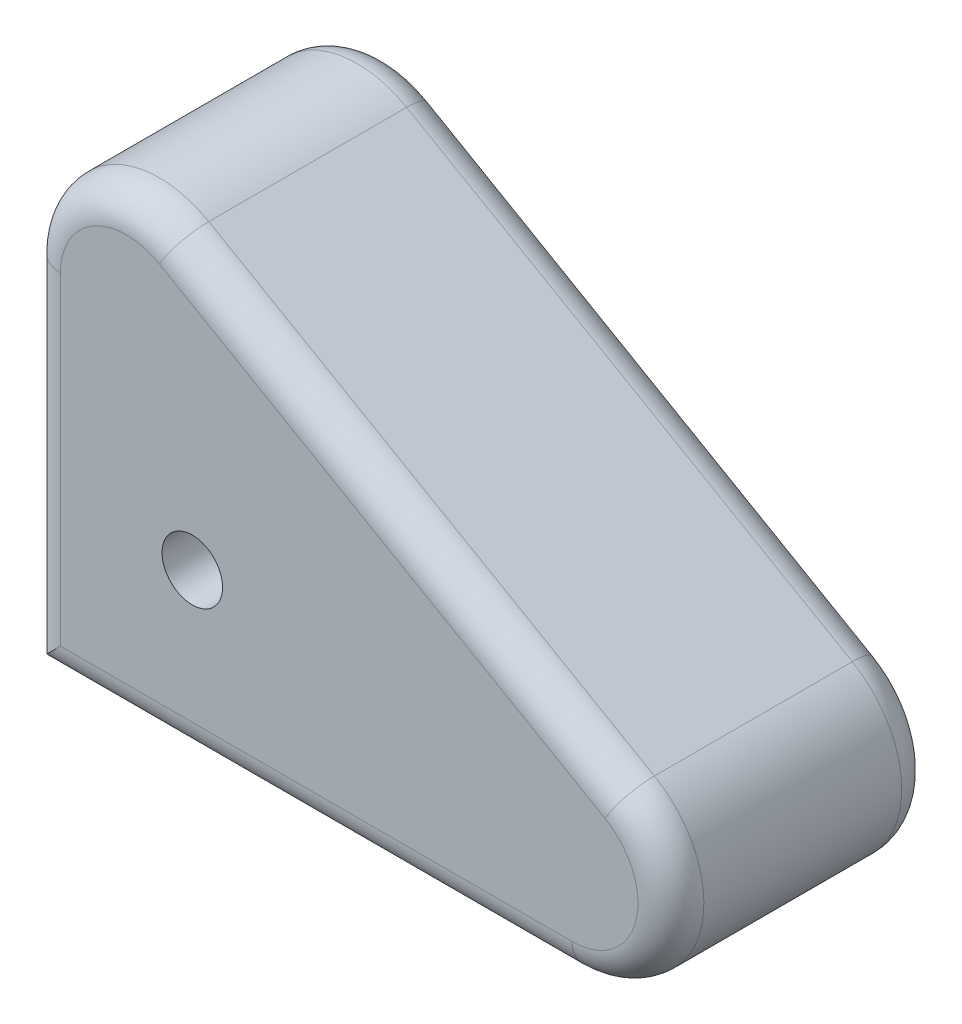
ISO-10303-21;
HEADER;
FILE_DESCRIPTION(('STEP AP214'),'2;1');
FILE_NAME('part.step','',(''),(''),'','','');
FILE_SCHEMA(('AUTOMOTIVE_DESIGN { 1 0 10303 214 1 1 1 1 }'));
ENDSEC;
DATA;
#1=APPLICATION_CONTEXT('core data for automotive mechanical design processes');
#2=APPLICATION_PROTOCOL_DEFINITION('international standard','automotive_design',2000,#1);
#3=PRODUCT_CONTEXT('',#1,'mechanical');
#4=PRODUCT('Part','Part','',(#3));
#5=PRODUCT_RELATED_PRODUCT_CATEGORY('part','',(#4));
#6=PRODUCT_DEFINITION_FORMATION('','',#4);
#7=PRODUCT_DEFINITION_CONTEXT('part definition',#1,'design');
#8=PRODUCT_DEFINITION('design','',#6,#7);
#9=PRODUCT_DEFINITION_SHAPE('','',#8);
#10=(LENGTH_UNIT() NAMED_UNIT(*) SI_UNIT(.MILLI.,.METRE.));
#11=(NAMED_UNIT(*) PLANE_ANGLE_UNIT() SI_UNIT($,.RADIAN.));
#12=(NAMED_UNIT(*) SI_UNIT($,.STERADIAN.) SOLID_ANGLE_UNIT());
#13=UNCERTAINTY_MEASURE_WITH_UNIT(LENGTH_MEASURE(1.E-05),#10,'distance_accuracy_value','');
#14=(GEOMETRIC_REPRESENTATION_CONTEXT(3) GLOBAL_UNCERTAINTY_ASSIGNED_CONTEXT((#13)) GLOBAL_UNIT_ASSIGNED_CONTEXT((#10,
#11,#12)) REPRESENTATION_CONTEXT('',''));
#15=CARTESIAN_POINT('',(0.,0.,0.));
#16=DIRECTION('',(0.,0.,1.));
#17=DIRECTION('',(1.,0.,0.));
#18=AXIS2_PLACEMENT_3D('',#15,#16,#17);
#19=CARTESIAN_POINT('',(73.1307941648125,-12.7,50.8000000000001));
#20=DIRECTION('',(0.,0.,-1.));
#21=DIRECTION('',(-1.,0.,0.));
#22=AXIS2_PLACEMENT_3D('',#19,#20,#21);
#23=PLANE('',#22);
#24=DIRECTION('',(0.,-1.,0.));
#25=VECTOR('',#24,1.);
#26=CARTESIAN_POINT('',(-25.4,-12.7,50.8000000000001));
#27=LINE('',#26,#25);
#28=CARTESIAN_POINT('',(-25.4,36.8544321158131,50.8000000000001));
#29=VERTEX_POINT('',#28);
#30=CARTESIAN_POINT('',(-25.4,-25.4,50.8000000000001));
#31=VERTEX_POINT('',#30);
#32=EDGE_CURVE('E65',#29,#31,#27,.T.);
#33=ORIENTED_EDGE('',*,*,#32,.T.);
#34=DIRECTION('',(1.,0.,0.));
#35=VECTOR('',#34,1.);
#36=CARTESIAN_POINT('',(73.1307941648125,-25.4,50.8000000000001));
#37=LINE('',#36,#35);
#38=CARTESIAN_POINT('',(73.1307941648124,-25.4,50.8000000000001));
#39=VERTEX_POINT('',#38);
#40=EDGE_CURVE('E233',#31,#39,#37,.T.);
#41=ORIENTED_EDGE('',*,*,#40,.T.);
#42=CARTESIAN_POINT('',(73.1307941648125,-12.7,50.8000000000001));
#43=DIRECTION('',(0.,0.,-1.));
#44=DIRECTION('',(-1.,0.,0.));
#45=AXIS2_PLACEMENT_3D('',#42,#43,#44);
#46=CIRCLE('',#45,12.7);
#47=CARTESIAN_POINT('',(79.4807941648123,-1.7014773719376,50.8000000000001));
#48=VERTEX_POINT('',#47);
#49=EDGE_CURVE('E150',#39,#48,#46,.F.);
#50=ORIENTED_EDGE('',*,*,#49,.T.);
#51=DIRECTION('',(-0.866025403784442,0.499999999999995,0.));
#52=VECTOR('',#51,1.);
#53=CARTESIAN_POINT('',(79.4807941648124,-1.70147737193762,50.8000000000001));
#54=LINE('',#53,#52);
#55=CARTESIAN_POINT('',(-6.35000000000008,47.8529547438755,50.8000000000001));
#56=VERTEX_POINT('',#55);
#57=EDGE_CURVE('E227',#48,#56,#54,.T.);
#58=ORIENTED_EDGE('',*,*,#57,.T.);
#59=CARTESIAN_POINT('',(-12.7,36.8544321158131,50.8000000000001));
#60=DIRECTION('',(0.,0.,-1.));
#61=DIRECTION('',(-1.,0.,0.));
#62=AXIS2_PLACEMENT_3D('',#59,#60,#61);
#63=CIRCLE('',#62,12.7);
#64=EDGE_CURVE('E229',#56,#29,#63,.F.);
#65=ORIENTED_EDGE('',*,*,#64,.T.);
#66=EDGE_LOOP('',(#33,#41,#50,#58,#65));
#67=FACE_BOUND('',#66,.T.);
#68=CARTESIAN_POINT('',(0.,0.,50.8000000000001));
#69=DIRECTION('',(0.,0.,1.));
#70=DIRECTION('',(1.,0.,0.));
#71=AXIS2_PLACEMENT_3D('',#68,#69,#70);
#72=CIRCLE('',#71,5.83012271365525);
#73=CARTESIAN_POINT('',(5.83012271365525,0.,50.8000000000001));
#74=VERTEX_POINT('',#73);
#75=EDGE_CURVE('E192',#74,#74,#72,.T.);
#76=ORIENTED_EDGE('',*,*,#75,.F.);
#77=EDGE_LOOP('',(#76));
#78=FACE_BOUND('',#77,.T.);
#79=ADVANCED_FACE('F40',(#67,#78),#23,.F.);
#80=CARTESIAN_POINT('',(73.1307941648125,-12.7,0.));
#81=DIRECTION('',(0.,0.,-1.));
#82=DIRECTION('',(-1.,0.,0.));
#83=AXIS2_PLACEMENT_3D('',#80,#81,#82);
#84=PLANE('',#83);
#85=CARTESIAN_POINT('',(73.1307941648125,-12.7,0.));
#86=DIRECTION('',(0.,0.,-1.));
#87=DIRECTION('',(-1.,0.,0.));
#88=AXIS2_PLACEMENT_3D('',#85,#86,#87);
#89=CIRCLE('',#88,12.7);
#90=CARTESIAN_POINT('',(79.4807941648123,-1.7014773719376,0.));
#91=VERTEX_POINT('',#90);
#92=CARTESIAN_POINT('',(73.1307941648124,-25.4,0.));
#93=VERTEX_POINT('',#92);
#94=EDGE_CURVE('E214',#91,#93,#89,.T.);
#95=ORIENTED_EDGE('',*,*,#94,.T.);
#96=DIRECTION('',(1.,0.,0.));
#97=VECTOR('',#96,1.);
#98=CARTESIAN_POINT('',(-31.75,-25.4,0.));
#99=LINE('',#98,#97);
#100=CARTESIAN_POINT('',(-25.4,-25.4,0.));
#101=VERTEX_POINT('',#100);
#102=EDGE_CURVE('E132',#93,#101,#99,.F.);
#103=ORIENTED_EDGE('',*,*,#102,.T.);
#104=DIRECTION('',(0.,-1.,0.));
#105=VECTOR('',#104,1.);
#106=CARTESIAN_POINT('',(-25.4,36.8544321158131,0.));
#107=LINE('',#106,#105);
#108=CARTESIAN_POINT('',(-25.4,36.8544321158131,0.));
#109=VERTEX_POINT('',#108);
#110=EDGE_CURVE('E212',#101,#109,#107,.F.);
#111=ORIENTED_EDGE('',*,*,#110,.T.);
#112=CARTESIAN_POINT('',(-12.7,36.8544321158131,0.));
#113=DIRECTION('',(0.,0.,-1.));
#114=DIRECTION('',(-1.,0.,0.));
#115=AXIS2_PLACEMENT_3D('',#112,#113,#114);
#116=CIRCLE('',#115,12.7);
#117=CARTESIAN_POINT('',(-6.35000000000008,47.8529547438755,0.));
#118=VERTEX_POINT('',#117);
#119=EDGE_CURVE('E210',#109,#118,#116,.T.);
#120=ORIENTED_EDGE('',*,*,#119,.T.);
#121=DIRECTION('',(-0.866025403784442,0.499999999999995,0.));
#122=VECTOR('',#121,1.);
#123=CARTESIAN_POINT('',(79.4807941648123,-1.70147737193759,0.));
#124=LINE('',#123,#122);
#125=EDGE_CURVE('E208',#118,#91,#124,.F.);
#126=ORIENTED_EDGE('',*,*,#125,.T.);
#127=EDGE_LOOP('',(#95,#103,#111,#120,#126));
#128=FACE_BOUND('',#127,.T.);
#129=CARTESIAN_POINT('',(0.,0.,0.));
#130=DIRECTION('',(0.,0.,1.));
#131=DIRECTION('',(1.,0.,0.));
#132=AXIS2_PLACEMENT_3D('',#129,#130,#131);
#133=CIRCLE('',#132,5.83012271365525);
#134=CARTESIAN_POINT('',(5.83012271365525,0.,0.));
#135=VERTEX_POINT('',#134);
#136=EDGE_CURVE('E186',#135,#135,#133,.T.);
#137=ORIENTED_EDGE('',*,*,#136,.T.);
#138=EDGE_LOOP('',(#137));
#139=FACE_BOUND('',#138,.T.);
#140=ADVANCED_FACE('F266',(#128,#139),#84,.T.);
#141=CARTESIAN_POINT('',(-31.75,36.8544321158131,50.8000000000001));
#142=DIRECTION('',(1.,0.,0.));
#143=DIRECTION('',(0.,1.,0.));
#144=AXIS2_PLACEMENT_3D('',#141,#142,#143);
#145=PLANE('',#144);
#146=DIRECTION('',(0.,0.,-1.));
#147=VECTOR('',#146,1.);
#148=CARTESIAN_POINT('',(-31.75,36.8544321158131,50.8000000000001));
#149=LINE('',#148,#147);
#150=CARTESIAN_POINT('',(-31.75,36.8544321158131,44.4500000000001));
#151=VERTEX_POINT('',#150);
#152=CARTESIAN_POINT('',(-31.75,36.8544321158131,6.35000000000001));
#153=VERTEX_POINT('',#152);
#154=EDGE_CURVE('E197',#151,#153,#149,.T.);
#155=ORIENTED_EDGE('',*,*,#154,.T.);
#156=DIRECTION('',(0.,-1.,0.));
#157=VECTOR('',#156,1.);
#158=CARTESIAN_POINT('',(-31.75,-31.75,6.35));
#159=LINE('',#158,#157);
#160=CARTESIAN_POINT('',(-31.75,-31.75,6.35000000000002));
#161=VERTEX_POINT('',#160);
#162=EDGE_CURVE('E221',#153,#161,#159,.T.);
#163=ORIENTED_EDGE('',*,*,#162,.T.);
#164=DIRECTION('',(0.,0.,-1.));
#165=VECTOR('',#164,1.);
#166=CARTESIAN_POINT('',(-31.75,-31.75,50.8000000000001));
#167=LINE('',#166,#165);
#168=CARTESIAN_POINT('',(-31.75,-31.75,44.4500000000001));
#169=VERTEX_POINT('',#168);
#170=EDGE_CURVE('E143',#169,#161,#167,.T.);
#171=ORIENTED_EDGE('',*,*,#170,.F.);
#172=DIRECTION('',(0.,-1.,0.));
#173=VECTOR('',#172,1.);
#174=CARTESIAN_POINT('',(-31.75,36.8544321158131,44.4500000000001));
#175=LINE('',#174,#173);
#176=EDGE_CURVE('E219',#169,#151,#175,.F.);
#177=ORIENTED_EDGE('',*,*,#176,.T.);
#178=EDGE_LOOP('',(#155,#163,#171,#177));
#179=FACE_BOUND('',#178,.T.);
#180=ADVANCED_FACE('F245',(#179),#145,.F.);
#181=CARTESIAN_POINT('',(-31.75,-31.75,50.8000000000001));
#182=DIRECTION('',(0.,1.,0.));
#183=DIRECTION('',(0.,0.,1.));
#184=AXIS2_PLACEMENT_3D('',#181,#182,#183);
#185=PLANE('',#184);
#186=ORIENTED_EDGE('',*,*,#170,.T.);
#187=DIRECTION('',(1.,0.,0.));
#188=VECTOR('',#187,1.);
#189=CARTESIAN_POINT('',(73.1307941648124,-31.75,6.35));
#190=LINE('',#189,#188);
#191=CARTESIAN_POINT('',(73.1307941648124,-31.75,6.35000000000001));
#192=VERTEX_POINT('',#191);
#193=EDGE_CURVE('E142',#161,#192,#190,.T.);
#194=ORIENTED_EDGE('',*,*,#193,.T.);
#195=DIRECTION('',(0.,0.,-1.));
#196=VECTOR('',#195,1.);
#197=CARTESIAN_POINT('',(73.1307941648124,-31.75,50.8000000000001));
#198=LINE('',#197,#196);
#199=CARTESIAN_POINT('',(73.1307941648124,-31.75,44.4500000000001));
#200=VERTEX_POINT('',#199);
#201=EDGE_CURVE('E125',#200,#192,#198,.T.);
#202=ORIENTED_EDGE('',*,*,#201,.F.);
#203=DIRECTION('',(1.,0.,0.));
#204=VECTOR('',#203,1.);
#205=CARTESIAN_POINT('',(-31.75,-31.75,44.4500000000001));
#206=LINE('',#205,#204);
#207=EDGE_CURVE('E139',#200,#169,#206,.F.);
#208=ORIENTED_EDGE('',*,*,#207,.T.);
#209=EDGE_LOOP('',(#186,#194,#202,#208));
#210=FACE_BOUND('',#209,.T.);
#211=ADVANCED_FACE('F138',(#210),#185,.F.);
#212=CARTESIAN_POINT('',(73.1307941648125,-12.7,50.8000000000001));
#213=DIRECTION('',(0.,0.,-1.));
#214=DIRECTION('',(-1.,0.,0.));
#215=AXIS2_PLACEMENT_3D('',#212,#213,#214);
#216=CYLINDRICAL_SURFACE('',#215,19.05);
#217=ORIENTED_EDGE('',*,*,#201,.T.);
#218=CARTESIAN_POINT('',(73.1307941648125,-12.7,6.34999999999999));
#219=DIRECTION('',(0.,0.,-1.));
#220=DIRECTION('',(-1.,0.,0.));
#221=AXIS2_PLACEMENT_3D('',#218,#219,#220);
#222=CIRCLE('',#221,19.05);
#223=CARTESIAN_POINT('',(82.6557941648123,3.79778394209363,6.35000000000002));
#224=VERTEX_POINT('',#223);
#225=EDGE_CURVE('E131',#192,#224,#222,.F.);
#226=ORIENTED_EDGE('',*,*,#225,.T.);
#227=DIRECTION('',(0.,0.,-1.));
#228=VECTOR('',#227,1.);
#229=CARTESIAN_POINT('',(82.6557941648123,3.79778394209363,50.8000000000001));
#230=LINE('',#229,#228);
#231=CARTESIAN_POINT('',(82.6557941648123,3.79778394209363,44.4500000000001));
#232=VERTEX_POINT('',#231);
#233=EDGE_CURVE('E127',#232,#224,#230,.T.);
#234=ORIENTED_EDGE('',*,*,#233,.F.);
#235=CARTESIAN_POINT('',(73.1307941648125,-12.7,44.4500000000001));
#236=DIRECTION('',(0.,0.,-1.));
#237=DIRECTION('',(-1.,0.,0.));
#238=AXIS2_PLACEMENT_3D('',#235,#236,#237);
#239=CIRCLE('',#238,19.05);
#240=EDGE_CURVE('E122',#232,#200,#239,.T.);
#241=ORIENTED_EDGE('',*,*,#240,.T.);
#242=EDGE_LOOP('',(#217,#226,#234,#241));
#243=FACE_BOUND('',#242,.T.);
#244=ADVANCED_FACE('F124',(#243),#216,.T.);
#245=CARTESIAN_POINT('',(82.6557941648123,3.79778394209362,50.8000000000001));
#246=DIRECTION('',(-0.499999999999995,-0.866025403784442,0.));
#247=DIRECTION('',(0.866025403784442,-0.499999999999995,0.));
#248=AXIS2_PLACEMENT_3D('',#245,#246,#247);
#249=PLANE('',#248);
#250=ORIENTED_EDGE('',*,*,#233,.T.);
#251=DIRECTION('',(-0.866025403784442,0.499999999999995,0.));
#252=VECTOR('',#251,1.);
#253=CARTESIAN_POINT('',(-3.17500000000012,53.3522160579067,6.35));
#254=LINE('',#253,#252);
#255=CARTESIAN_POINT('',(-3.17500000000012,53.3522160579067,6.35000000000002));
#256=VERTEX_POINT('',#255);
#257=EDGE_CURVE('E11',#224,#256,#254,.T.);
#258=ORIENTED_EDGE('',*,*,#257,.T.);
#259=DIRECTION('',(0.,0.,-1.));
#260=VECTOR('',#259,1.);
#261=CARTESIAN_POINT('',(-3.17500000000012,53.3522160579067,50.8000000000001));
#262=LINE('',#261,#260);
#263=CARTESIAN_POINT('',(-3.17500000000012,53.3522160579067,44.4500000000001));
#264=VERTEX_POINT('',#263);
#265=EDGE_CURVE('E202',#264,#256,#262,.T.);
#266=ORIENTED_EDGE('',*,*,#265,.F.);
#267=DIRECTION('',(-0.866025403784442,0.499999999999995,0.));
#268=VECTOR('',#267,1.);
#269=CARTESIAN_POINT('',(82.6557941648123,3.79778394209362,44.4500000000001));
#270=LINE('',#269,#268);
#271=EDGE_CURVE('E49',#264,#232,#270,.F.);
#272=ORIENTED_EDGE('',*,*,#271,.T.);
#273=EDGE_LOOP('',(#250,#258,#266,#272));
#274=FACE_BOUND('',#273,.T.);
#275=ADVANCED_FACE('F236',(#274),#249,.F.);
#276=CARTESIAN_POINT('',(-12.7,36.8544321158131,50.8000000000001));
#277=DIRECTION('',(0.,0.,-1.));
#278=DIRECTION('',(-1.,0.,0.));
#279=AXIS2_PLACEMENT_3D('',#276,#277,#278);
#280=CYLINDRICAL_SURFACE('',#279,19.05);
#281=ORIENTED_EDGE('',*,*,#265,.T.);
#282=CARTESIAN_POINT('',(-12.7,36.8544321158131,6.34999999999999));
#283=DIRECTION('',(0.,0.,-1.));
#284=DIRECTION('',(-1.,0.,0.));
#285=AXIS2_PLACEMENT_3D('',#282,#283,#284);
#286=CIRCLE('',#285,19.05);
#287=EDGE_CURVE('E225',#256,#153,#286,.F.);
#288=ORIENTED_EDGE('',*,*,#287,.T.);
#289=ORIENTED_EDGE('',*,*,#154,.F.);
#290=CARTESIAN_POINT('',(-12.7,36.8544321158131,44.4500000000001));
#291=DIRECTION('',(0.,0.,-1.));
#292=DIRECTION('',(-1.,0.,0.));
#293=AXIS2_PLACEMENT_3D('',#290,#291,#292);
#294=CIRCLE('',#293,19.05);
#295=EDGE_CURVE('E223',#151,#264,#294,.T.);
#296=ORIENTED_EDGE('',*,*,#295,.T.);
#297=EDGE_LOOP('',(#281,#288,#289,#296));
#298=FACE_BOUND('',#297,.T.);
#299=ADVANCED_FACE('F247',(#298),#280,.T.);
#300=CARTESIAN_POINT('',(0.,0.,50.8000000000001));
#301=DIRECTION('',(0.,0.,-1.));
#302=DIRECTION('',(-1.,0.,0.));
#303=AXIS2_PLACEMENT_3D('',#300,#301,#302);
#304=CYLINDRICAL_SURFACE('',#303,5.83012271365525);
#305=ORIENTED_EDGE('',*,*,#75,.T.);
#306=EDGE_LOOP('',(#305));
#307=FACE_BOUND('',#306,.T.);
#308=ORIENTED_EDGE('',*,*,#136,.F.);
#309=EDGE_LOOP('',(#308));
#310=FACE_BOUND('',#309,.T.);
#311=ADVANCED_FACE('F274',(#307,#310),#304,.F.);
#312=CARTESIAN_POINT('',(-12.7,36.8544321158131,6.35));
#313=DIRECTION('',(0.,0.,-1.));
#314=DIRECTION('',(-1.,0.,0.));
#315=AXIS2_PLACEMENT_3D('',#312,#313,#314);
#316=TOROIDAL_SURFACE('',#315,12.7,6.35);
#317=CARTESIAN_POINT('',(-25.4,36.8544321158131,6.35));
#318=DIRECTION('',(0.,-1.,0.));
#319=DIRECTION('',(0.,0.,-1.));
#320=AXIS2_PLACEMENT_3D('',#317,#318,#319);
#321=CIRCLE('',#320,6.35);
#322=EDGE_CURVE('E179',#153,#109,#321,.T.);
#323=ORIENTED_EDGE('',*,*,#322,.F.);
#324=ORIENTED_EDGE('',*,*,#287,.F.);
#325=CARTESIAN_POINT('',(-6.35000000000008,47.8529547438755,6.35));
#326=DIRECTION('',(0.866025403784442,-0.499999999999994,0.));
#327=DIRECTION('',(0.499999999999994,0.866025403784442,0.));
#328=AXIS2_PLACEMENT_3D('',#325,#326,#327);
#329=CIRCLE('',#328,6.35);
#330=EDGE_CURVE('E155',#118,#256,#329,.T.);
#331=ORIENTED_EDGE('',*,*,#330,.F.);
#332=ORIENTED_EDGE('',*,*,#119,.F.);
#333=EDGE_LOOP('',(#323,#324,#331,#332));
#334=FACE_BOUND('',#333,.T.);
#335=ADVANCED_FACE('F250',(#334),#316,.T.);
#336=CARTESIAN_POINT('',(79.4807941648123,-1.70147737193759,6.35));
#337=DIRECTION('',(0.866025403784442,-0.499999999999995,0.));
#338=DIRECTION('',(0.499999999999995,0.866025403784442,0.));
#339=AXIS2_PLACEMENT_3D('',#336,#337,#338);
#340=CYLINDRICAL_SURFACE('',#339,6.35);
#341=ORIENTED_EDGE('',*,*,#330,.T.);
#342=ORIENTED_EDGE('',*,*,#257,.F.);
#343=CARTESIAN_POINT('',(79.4807941648123,-1.7014773719376,6.35));
#344=DIRECTION('',(0.866025403784444,-0.499999999999991,0.));
#345=DIRECTION('',(0.499999999999991,0.866025403784444,0.));
#346=AXIS2_PLACEMENT_3D('',#343,#344,#345);
#347=CIRCLE('',#346,6.35);
#348=EDGE_CURVE('E174',#91,#224,#347,.T.);
#349=ORIENTED_EDGE('',*,*,#348,.F.);
#350=ORIENTED_EDGE('',*,*,#125,.F.);
#351=EDGE_LOOP('',(#341,#342,#349,#350));
#352=FACE_BOUND('',#351,.T.);
#353=ADVANCED_FACE('F316',(#352),#340,.T.);
#354=CARTESIAN_POINT('',(-25.4,36.8544321158131,6.35));
#355=DIRECTION('',(0.,1.,0.));
#356=DIRECTION('',(-1.,0.,0.));
#357=AXIS2_PLACEMENT_3D('',#354,#355,#356);
#358=CYLINDRICAL_SURFACE('',#357,6.35);
#359=ORIENTED_EDGE('',*,*,#322,.T.);
#360=ORIENTED_EDGE('',*,*,#110,.F.);
#361=CARTESIAN_POINT('',(-25.4,-25.4,6.35));
#362=DIRECTION('',(-0.707106781186547,0.707106781186547,0.));
#363=DIRECTION('',(0.707106781186547,0.707106781186548,0.));
#364=AXIS2_PLACEMENT_3D('',#361,#362,#363);
#365=ELLIPSE('',#364,8.98025612106915,6.35);
#366=EDGE_CURVE('E168',#161,#101,#365,.F.);
#367=ORIENTED_EDGE('',*,*,#366,.F.);
#368=ORIENTED_EDGE('',*,*,#162,.F.);
#369=EDGE_LOOP('',(#359,#360,#367,#368));
#370=FACE_BOUND('',#369,.T.);
#371=ADVANCED_FACE('F253',(#370),#358,.T.);
#372=CARTESIAN_POINT('',(73.1307941648125,-12.7,6.35));
#373=DIRECTION('',(0.,0.,-1.));
#374=DIRECTION('',(-1.,0.,0.));
#375=AXIS2_PLACEMENT_3D('',#372,#373,#374);
#376=TOROIDAL_SURFACE('',#375,12.7,6.35);
#377=ORIENTED_EDGE('',*,*,#348,.T.);
#378=ORIENTED_EDGE('',*,*,#225,.F.);
#379=CARTESIAN_POINT('',(73.1307941648124,-25.4,6.35));
#380=DIRECTION('',(-1.,0.,0.));
#381=DIRECTION('',(0.,0.,1.));
#382=AXIS2_PLACEMENT_3D('',#379,#380,#381);
#383=CIRCLE('',#382,6.35);
#384=EDGE_CURVE('E163',#93,#192,#383,.T.);
#385=ORIENTED_EDGE('',*,*,#384,.F.);
#386=ORIENTED_EDGE('',*,*,#94,.F.);
#387=EDGE_LOOP('',(#377,#378,#385,#386));
#388=FACE_BOUND('',#387,.T.);
#389=ADVANCED_FACE('F256',(#388),#376,.T.);
#390=CARTESIAN_POINT('',(-31.75,-25.4,6.35));
#391=DIRECTION('',(-1.,0.,0.));
#392=DIRECTION('',(0.,0.,1.));
#393=AXIS2_PLACEMENT_3D('',#390,#391,#392);
#394=CYLINDRICAL_SURFACE('',#393,6.35);
#395=ORIENTED_EDGE('',*,*,#366,.T.);
#396=ORIENTED_EDGE('',*,*,#102,.F.);
#397=ORIENTED_EDGE('',*,*,#384,.T.);
#398=ORIENTED_EDGE('',*,*,#193,.F.);
#399=EDGE_LOOP('',(#395,#396,#397,#398));
#400=FACE_BOUND('',#399,.T.);
#401=ADVANCED_FACE('F254',(#400),#394,.T.);
#402=CARTESIAN_POINT('',(-12.7,36.8544321158131,44.4500000000001));
#403=DIRECTION('',(0.,0.,-1.));
#404=DIRECTION('',(-1.,0.,0.));
#405=AXIS2_PLACEMENT_3D('',#402,#403,#404);
#406=TOROIDAL_SURFACE('',#405,12.7,6.35);
#407=CARTESIAN_POINT('',(-25.4,36.8544321158131,44.4500000000001));
#408=DIRECTION('',(0.,-1.,0.));
#409=DIRECTION('',(0.,0.,-1.));
#410=AXIS2_PLACEMENT_3D('',#407,#408,#409);
#411=CIRCLE('',#410,6.35);
#412=EDGE_CURVE('E158',#29,#151,#411,.T.);
#413=ORIENTED_EDGE('',*,*,#412,.F.);
#414=ORIENTED_EDGE('',*,*,#64,.F.);
#415=CARTESIAN_POINT('',(-6.35000000000008,47.8529547438755,44.4500000000001));
#416=DIRECTION('',(0.866025403784442,-0.499999999999994,0.));
#417=DIRECTION('',(0.499999999999994,0.866025403784442,0.));
#418=AXIS2_PLACEMENT_3D('',#415,#416,#417);
#419=CIRCLE('',#418,6.35);
#420=EDGE_CURVE('E44',#264,#56,#419,.T.);
#421=ORIENTED_EDGE('',*,*,#420,.F.);
#422=ORIENTED_EDGE('',*,*,#295,.F.);
#423=EDGE_LOOP('',(#413,#414,#421,#422));
#424=FACE_BOUND('',#423,.T.);
#425=ADVANCED_FACE('F42',(#424),#406,.T.);
#426=CARTESIAN_POINT('',(79.4807941648124,-1.70147737193762,44.4500000000001));
#427=DIRECTION('',(-0.866025403784442,0.499999999999995,0.));
#428=DIRECTION('',(-0.499999999999995,-0.866025403784442,0.));
#429=AXIS2_PLACEMENT_3D('',#426,#427,#428);
#430=CYLINDRICAL_SURFACE('',#429,6.35);
#431=ORIENTED_EDGE('',*,*,#420,.T.);
#432=ORIENTED_EDGE('',*,*,#57,.F.);
#433=CARTESIAN_POINT('',(79.4807941648123,-1.70147737193759,44.4500000000001));
#434=DIRECTION('',(0.866025403784441,-0.499999999999995,0.));
#435=DIRECTION('',(0.499999999999995,0.866025403784441,0.));
#436=AXIS2_PLACEMENT_3D('',#433,#434,#435);
#437=CIRCLE('',#436,6.35);
#438=EDGE_CURVE('E152',#232,#48,#437,.T.);
#439=ORIENTED_EDGE('',*,*,#438,.F.);
#440=ORIENTED_EDGE('',*,*,#271,.F.);
#441=EDGE_LOOP('',(#431,#432,#439,#440));
#442=FACE_BOUND('',#441,.T.);
#443=ADVANCED_FACE('F237',(#442),#430,.T.);
#444=CARTESIAN_POINT('',(-25.4,-12.7,44.4500000000001));
#445=DIRECTION('',(0.,-1.,0.));
#446=DIRECTION('',(1.,0.,0.));
#447=AXIS2_PLACEMENT_3D('',#444,#445,#446);
#448=CYLINDRICAL_SURFACE('',#447,6.35);
#449=ORIENTED_EDGE('',*,*,#412,.T.);
#450=ORIENTED_EDGE('',*,*,#176,.F.);
#451=CARTESIAN_POINT('',(-25.4,-25.4,44.4500000000001));
#452=DIRECTION('',(0.707106781186547,-0.707106781186547,0.));
#453=DIRECTION('',(-0.707106781186547,-0.707106781186548,0.));
#454=AXIS2_PLACEMENT_3D('',#451,#452,#453);
#455=ELLIPSE('',#454,8.98025612106915,6.35);
#456=EDGE_CURVE('E146',#31,#169,#455,.T.);
#457=ORIENTED_EDGE('',*,*,#456,.F.);
#458=ORIENTED_EDGE('',*,*,#32,.F.);
#459=EDGE_LOOP('',(#449,#450,#457,#458));
#460=FACE_BOUND('',#459,.T.);
#461=ADVANCED_FACE('F242',(#460),#448,.T.);
#462=CARTESIAN_POINT('',(73.1307941648125,-12.7,44.4500000000001));
#463=DIRECTION('',(0.,0.,-1.));
#464=DIRECTION('',(-1.,0.,0.));
#465=AXIS2_PLACEMENT_3D('',#462,#463,#464);
#466=TOROIDAL_SURFACE('',#465,12.7,6.35);
#467=ORIENTED_EDGE('',*,*,#438,.T.);
#468=ORIENTED_EDGE('',*,*,#49,.F.);
#469=CARTESIAN_POINT('',(73.1307941648124,-25.4,44.4500000000001));
#470=DIRECTION('',(-1.,0.,0.));
#471=DIRECTION('',(0.,0.,1.));
#472=AXIS2_PLACEMENT_3D('',#469,#470,#471);
#473=CIRCLE('',#472,6.35);
#474=EDGE_CURVE('E57',#200,#39,#473,.T.);
#475=ORIENTED_EDGE('',*,*,#474,.F.);
#476=ORIENTED_EDGE('',*,*,#240,.F.);
#477=EDGE_LOOP('',(#467,#468,#475,#476));
#478=FACE_BOUND('',#477,.T.);
#479=ADVANCED_FACE('F149',(#478),#466,.T.);
#480=CARTESIAN_POINT('',(73.1307941648125,-25.4,44.4500000000001));
#481=DIRECTION('',(1.,0.,0.));
#482=DIRECTION('',(0.,0.,-1.));
#483=AXIS2_PLACEMENT_3D('',#480,#481,#482);
#484=CYLINDRICAL_SURFACE('',#483,6.35);
#485=ORIENTED_EDGE('',*,*,#456,.T.);
#486=ORIENTED_EDGE('',*,*,#207,.F.);
#487=ORIENTED_EDGE('',*,*,#474,.T.);
#488=ORIENTED_EDGE('',*,*,#40,.F.);
#489=EDGE_LOOP('',(#485,#486,#487,#488));
#490=FACE_BOUND('',#489,.T.);
#491=ADVANCED_FACE('F145',(#490),#484,.T.);
#492=CLOSED_SHELL('',(#79,#140,#180,#211,#244,#275,#299,#311,#335,#353,#371,#389,#401,#425,#443,
#461,#479,#491));
#493=MANIFOLD_SOLID_BREP('B2',#492);
#494=ADVANCED_BREP_SHAPE_REPRESENTATION('',(#18,#493),#14);
#495=SHAPE_DEFINITION_REPRESENTATION(#9,#494);
ENDSEC;
END-ISO-10303-21;
